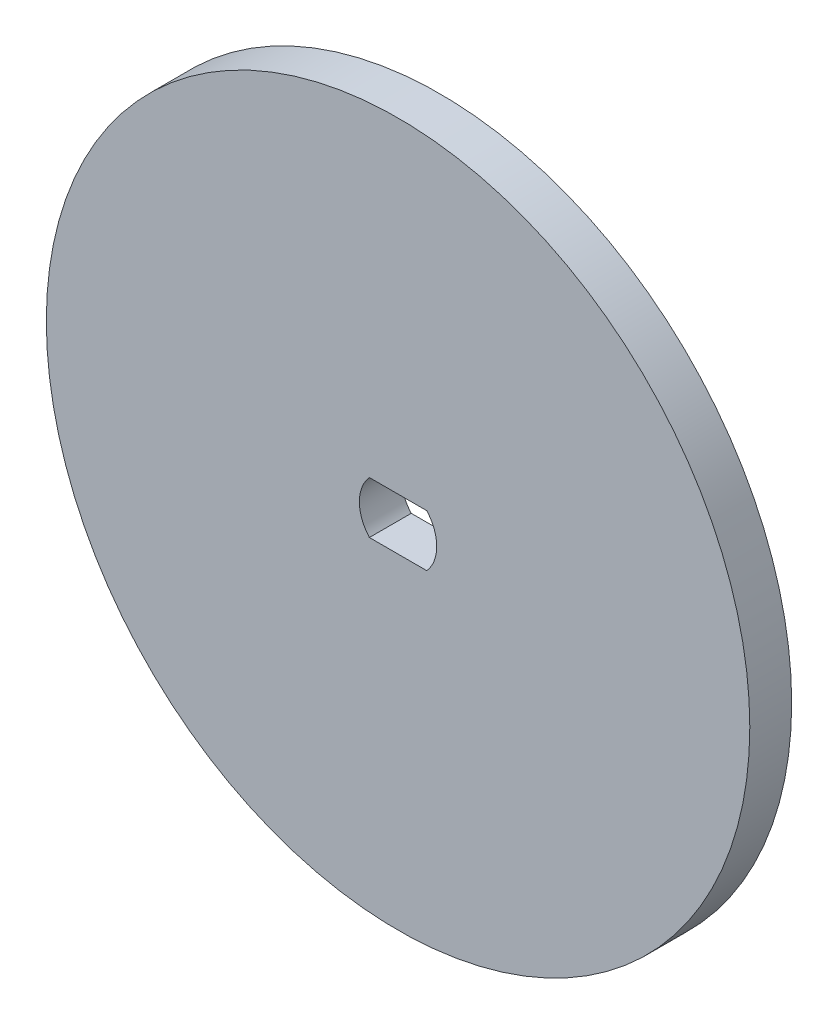
ISO-10303-21;
HEADER;
FILE_DESCRIPTION(('STEP AP214'),'2;1');
FILE_NAME('part.step','',(''),(''),'','','');
FILE_SCHEMA(('AUTOMOTIVE_DESIGN { 1 0 10303 214 1 1 1 1 }'));
ENDSEC;
DATA;
#1=APPLICATION_CONTEXT('core data for automotive mechanical design processes');
#2=APPLICATION_PROTOCOL_DEFINITION('international standard','automotive_design',2000,#1);
#3=PRODUCT_CONTEXT('',#1,'mechanical');
#4=PRODUCT('Part','Part','',(#3));
#5=PRODUCT_RELATED_PRODUCT_CATEGORY('part','',(#4));
#6=PRODUCT_DEFINITION_FORMATION('','',#4);
#7=PRODUCT_DEFINITION_CONTEXT('part definition',#1,'design');
#8=PRODUCT_DEFINITION('design','',#6,#7);
#9=PRODUCT_DEFINITION_SHAPE('','',#8);
#10=(LENGTH_UNIT() NAMED_UNIT(*) SI_UNIT(.MILLI.,.METRE.));
#11=(NAMED_UNIT(*) PLANE_ANGLE_UNIT() SI_UNIT($,.RADIAN.));
#12=(NAMED_UNIT(*) SI_UNIT($,.STERADIAN.) SOLID_ANGLE_UNIT());
#13=UNCERTAINTY_MEASURE_WITH_UNIT(LENGTH_MEASURE(1.E-05),#10,'distance_accuracy_value','');
#14=(GEOMETRIC_REPRESENTATION_CONTEXT(3) GLOBAL_UNCERTAINTY_ASSIGNED_CONTEXT((#13)) GLOBAL_UNIT_ASSIGNED_CONTEXT((#10,
#11,#12)) REPRESENTATION_CONTEXT('',''));
#15=CARTESIAN_POINT('',(0.,0.,0.));
#16=DIRECTION('',(0.,0.,1.));
#17=DIRECTION('',(1.,0.,0.));
#18=AXIS2_PLACEMENT_3D('',#15,#16,#17);
#19=CARTESIAN_POINT('',(0.,0.,3.175));
#20=DIRECTION('',(0.,0.,-1.));
#21=DIRECTION('',(-1.,0.,0.));
#22=AXIS2_PLACEMENT_3D('',#19,#20,#21);
#23=CYLINDRICAL_SURFACE('',#22,2.9337);
#24=CARTESIAN_POINT('',(0.,0.,0.));
#25=DIRECTION('',(0.,0.,1.));
#26=DIRECTION('',(1.,0.,0.));
#27=AXIS2_PLACEMENT_3D('',#24,#25,#26);
#28=CIRCLE('',#27,2.9337);
#29=CARTESIAN_POINT('',(-2.17522491710627,1.9685,0.));
#30=VERTEX_POINT('',#29);
#31=CARTESIAN_POINT('',(-2.17522491710627,-1.9685,0.));
#32=VERTEX_POINT('',#31);
#33=EDGE_CURVE('E101',#30,#32,#28,.T.);
#34=ORIENTED_EDGE('',*,*,#33,.F.);
#35=DIRECTION('',(0.,0.,-1.));
#36=VECTOR('',#35,1.);
#37=CARTESIAN_POINT('',(-2.17522491710627,1.9685,3.175));
#38=LINE('',#37,#36);
#39=CARTESIAN_POINT('',(-2.17522491710627,1.9685,3.175));
#40=VERTEX_POINT('',#39);
#41=EDGE_CURVE('E11',#40,#30,#38,.T.);
#42=ORIENTED_EDGE('',*,*,#41,.F.);
#43=CARTESIAN_POINT('',(0.,0.,3.175));
#44=DIRECTION('',(0.,0.,1.));
#45=DIRECTION('',(1.,0.,0.));
#46=AXIS2_PLACEMENT_3D('',#43,#44,#45);
#47=CIRCLE('',#46,2.9337);
#48=CARTESIAN_POINT('',(-2.17522491710627,-1.9685,3.175));
#49=VERTEX_POINT('',#48);
#50=EDGE_CURVE('E83',#40,#49,#47,.T.);
#51=ORIENTED_EDGE('',*,*,#50,.T.);
#52=DIRECTION('',(0.,0.,-1.));
#53=VECTOR('',#52,1.);
#54=CARTESIAN_POINT('',(-2.17522491710627,-1.9685,3.175));
#55=LINE('',#54,#53);
#56=EDGE_CURVE('E50',#49,#32,#55,.T.);
#57=ORIENTED_EDGE('',*,*,#56,.T.);
#58=EDGE_LOOP('',(#34,#42,#51,#57));
#59=FACE_BOUND('',#58,.T.);
#60=ADVANCED_FACE('F34',(#59),#23,.F.);
#61=CARTESIAN_POINT('',(0.,1.9685,3.175));
#62=DIRECTION('',(0.,1.,0.));
#63=DIRECTION('',(0.,0.,1.));
#64=AXIS2_PLACEMENT_3D('',#61,#62,#63);
#65=PLANE('',#64);
#66=DIRECTION('',(1.,0.,0.));
#67=VECTOR('',#66,1.);
#68=CARTESIAN_POINT('',(0.,1.9685,0.));
#69=LINE('',#68,#67);
#70=CARTESIAN_POINT('',(2.17522491710627,1.9685,0.));
#71=VERTEX_POINT('',#70);
#72=EDGE_CURVE('E89',#30,#71,#69,.T.);
#73=ORIENTED_EDGE('',*,*,#72,.T.);
#74=DIRECTION('',(0.,0.,-1.));
#75=VECTOR('',#74,1.);
#76=CARTESIAN_POINT('',(2.17522491710627,1.9685,3.175));
#77=LINE('',#76,#75);
#78=CARTESIAN_POINT('',(2.17522491710627,1.9685,3.175));
#79=VERTEX_POINT('',#78);
#80=EDGE_CURVE('E42',#79,#71,#77,.T.);
#81=ORIENTED_EDGE('',*,*,#80,.F.);
#82=DIRECTION('',(1.,0.,0.));
#83=VECTOR('',#82,1.);
#84=CARTESIAN_POINT('',(0.,1.9685,3.175));
#85=LINE('',#84,#83);
#86=EDGE_CURVE('E76',#40,#79,#85,.T.);
#87=ORIENTED_EDGE('',*,*,#86,.F.);
#88=ORIENTED_EDGE('',*,*,#41,.T.);
#89=EDGE_LOOP('',(#73,#81,#87,#88));
#90=FACE_BOUND('',#89,.T.);
#91=ADVANCED_FACE('F87',(#90),#65,.F.);
#92=CARTESIAN_POINT('',(0.,0.,3.175));
#93=DIRECTION('',(0.,0.,-1.));
#94=DIRECTION('',(-1.,0.,0.));
#95=AXIS2_PLACEMENT_3D('',#92,#93,#94);
#96=CYLINDRICAL_SURFACE('',#95,2.9337);
#97=CARTESIAN_POINT('',(0.,0.,0.));
#98=DIRECTION('',(0.,0.,1.));
#99=DIRECTION('',(1.,0.,0.));
#100=AXIS2_PLACEMENT_3D('',#97,#98,#99);
#101=CIRCLE('',#100,2.9337);
#102=CARTESIAN_POINT('',(2.17522491710627,-1.9685,0.));
#103=VERTEX_POINT('',#102);
#104=EDGE_CURVE('E104',#103,#71,#101,.T.);
#105=ORIENTED_EDGE('',*,*,#104,.F.);
#106=DIRECTION('',(0.,0.,-1.));
#107=VECTOR('',#106,1.);
#108=CARTESIAN_POINT('',(2.17522491710627,-1.9685,3.175));
#109=LINE('',#108,#107);
#110=CARTESIAN_POINT('',(2.17522491710627,-1.9685,3.175));
#111=VERTEX_POINT('',#110);
#112=EDGE_CURVE('E63',#111,#103,#109,.T.);
#113=ORIENTED_EDGE('',*,*,#112,.F.);
#114=CARTESIAN_POINT('',(0.,0.,3.175));
#115=DIRECTION('',(0.,0.,1.));
#116=DIRECTION('',(1.,0.,0.));
#117=AXIS2_PLACEMENT_3D('',#114,#115,#116);
#118=CIRCLE('',#117,2.9337);
#119=EDGE_CURVE('E82',#111,#79,#118,.T.);
#120=ORIENTED_EDGE('',*,*,#119,.T.);
#121=ORIENTED_EDGE('',*,*,#80,.T.);
#122=EDGE_LOOP('',(#105,#113,#120,#121));
#123=FACE_BOUND('',#122,.T.);
#124=ADVANCED_FACE('F92',(#123),#96,.F.);
#125=CARTESIAN_POINT('',(0.,-1.9685,3.175));
#126=DIRECTION('',(0.,1.,0.));
#127=DIRECTION('',(0.,0.,1.));
#128=AXIS2_PLACEMENT_3D('',#125,#126,#127);
#129=PLANE('',#128);
#130=DIRECTION('',(1.,0.,0.));
#131=VECTOR('',#130,1.);
#132=CARTESIAN_POINT('',(0.,-1.9685,0.));
#133=LINE('',#132,#131);
#134=EDGE_CURVE('E106',#32,#103,#133,.T.);
#135=ORIENTED_EDGE('',*,*,#134,.F.);
#136=ORIENTED_EDGE('',*,*,#56,.F.);
#137=DIRECTION('',(1.,0.,0.));
#138=VECTOR('',#137,1.);
#139=CARTESIAN_POINT('',(0.,-1.9685,3.175));
#140=LINE('',#139,#138);
#141=EDGE_CURVE('E93',#49,#111,#140,.T.);
#142=ORIENTED_EDGE('',*,*,#141,.T.);
#143=ORIENTED_EDGE('',*,*,#112,.T.);
#144=EDGE_LOOP('',(#135,#136,#142,#143));
#145=FACE_BOUND('',#144,.T.);
#146=ADVANCED_FACE('F115',(#145),#129,.T.);
#147=CARTESIAN_POINT('',(0.,0.,3.175));
#148=DIRECTION('',(0.,0.,-1.));
#149=DIRECTION('',(-1.,0.,0.));
#150=AXIS2_PLACEMENT_3D('',#147,#148,#149);
#151=CYLINDRICAL_SURFACE('',#150,26.67);
#152=CARTESIAN_POINT('',(0.,0.,3.175));
#153=DIRECTION('',(0.,0.,1.));
#154=DIRECTION('',(1.,0.,0.));
#155=AXIS2_PLACEMENT_3D('',#152,#153,#154);
#156=CIRCLE('',#155,26.67);
#157=CARTESIAN_POINT('',(26.67,0.,3.175));
#158=VERTEX_POINT('',#157);
#159=EDGE_CURVE('E95',#158,#158,#156,.T.);
#160=ORIENTED_EDGE('',*,*,#159,.F.);
#161=EDGE_LOOP('',(#160));
#162=FACE_BOUND('',#161,.T.);
#163=CARTESIAN_POINT('',(0.,0.,0.));
#164=DIRECTION('',(0.,0.,1.));
#165=DIRECTION('',(1.,0.,0.));
#166=AXIS2_PLACEMENT_3D('',#163,#164,#165);
#167=CIRCLE('',#166,26.67);
#168=CARTESIAN_POINT('',(26.67,0.,0.));
#169=VERTEX_POINT('',#168);
#170=EDGE_CURVE('E109',#169,#169,#167,.T.);
#171=ORIENTED_EDGE('',*,*,#170,.T.);
#172=EDGE_LOOP('',(#171));
#173=FACE_BOUND('',#172,.T.);
#174=ADVANCED_FACE('F117',(#162,#173),#151,.T.);
#175=CARTESIAN_POINT('',(0.,0.,3.175));
#176=DIRECTION('',(0.,0.,1.));
#177=DIRECTION('',(1.,0.,0.));
#178=AXIS2_PLACEMENT_3D('',#175,#176,#177);
#179=PLANE('',#178);
#180=ORIENTED_EDGE('',*,*,#50,.F.);
#181=ORIENTED_EDGE('',*,*,#86,.T.);
#182=ORIENTED_EDGE('',*,*,#119,.F.);
#183=ORIENTED_EDGE('',*,*,#141,.F.);
#184=EDGE_LOOP('',(#180,#181,#182,#183));
#185=FACE_BOUND('',#184,.T.);
#186=ORIENTED_EDGE('',*,*,#159,.T.);
#187=EDGE_LOOP('',(#186));
#188=FACE_BOUND('',#187,.T.);
#189=ADVANCED_FACE('F78',(#185,#188),#179,.T.);
#190=CARTESIAN_POINT('',(0.,0.,0.));
#191=DIRECTION('',(0.,0.,1.));
#192=DIRECTION('',(1.,0.,0.));
#193=AXIS2_PLACEMENT_3D('',#190,#191,#192);
#194=PLANE('',#193);
#195=ORIENTED_EDGE('',*,*,#33,.T.);
#196=ORIENTED_EDGE('',*,*,#134,.T.);
#197=ORIENTED_EDGE('',*,*,#104,.T.);
#198=ORIENTED_EDGE('',*,*,#72,.F.);
#199=EDGE_LOOP('',(#195,#196,#197,#198));
#200=FACE_BOUND('',#199,.T.);
#201=ORIENTED_EDGE('',*,*,#170,.F.);
#202=EDGE_LOOP('',(#201));
#203=FACE_BOUND('',#202,.T.);
#204=ADVANCED_FACE('F155',(#200,#203),#194,.F.);
#205=CLOSED_SHELL('',(#60,#91,#124,#146,#174,#189,#204));
#206=MANIFOLD_SOLID_BREP('B2',#205);
#207=ADVANCED_BREP_SHAPE_REPRESENTATION('',(#18,#206),#14);
#208=SHAPE_DEFINITION_REPRESENTATION(#9,#207);
ENDSEC;
END-ISO-10303-21;
